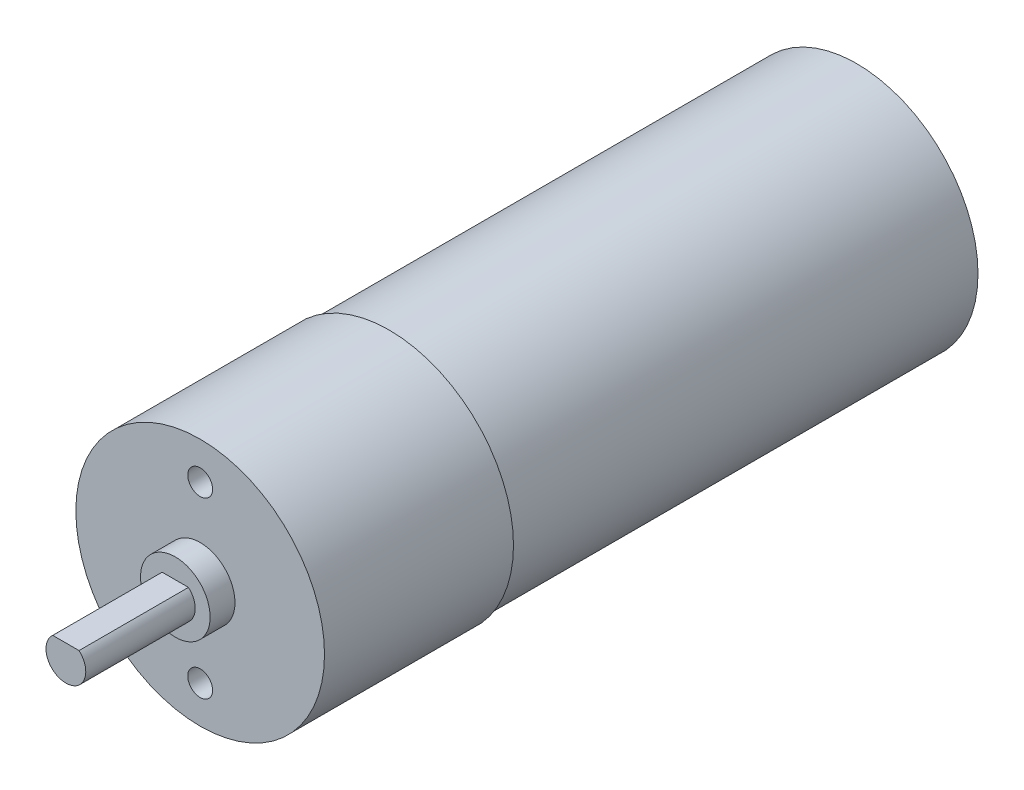
ISO-10303-21;
HEADER;
FILE_DESCRIPTION(('STEP AP214'),'2;1');
FILE_NAME('part.step','',(''),(''),'','','');
FILE_SCHEMA(('AUTOMOTIVE_DESIGN { 1 0 10303 214 1 1 1 1 }'));
ENDSEC;
DATA;
#1=APPLICATION_CONTEXT('core data for automotive mechanical design processes');
#2=APPLICATION_PROTOCOL_DEFINITION('international standard','automotive_design',2000,#1);
#3=PRODUCT_CONTEXT('',#1,'mechanical');
#4=PRODUCT('Part','Part','',(#3));
#5=PRODUCT_RELATED_PRODUCT_CATEGORY('part','',(#4));
#6=PRODUCT_DEFINITION_FORMATION('','',#4);
#7=PRODUCT_DEFINITION_CONTEXT('part definition',#1,'design');
#8=PRODUCT_DEFINITION('design','',#6,#7);
#9=PRODUCT_DEFINITION_SHAPE('','',#8);
#10=(LENGTH_UNIT() NAMED_UNIT(*) SI_UNIT(.MILLI.,.METRE.));
#11=(NAMED_UNIT(*) PLANE_ANGLE_UNIT() SI_UNIT($,.RADIAN.));
#12=(NAMED_UNIT(*) SI_UNIT($,.STERADIAN.) SOLID_ANGLE_UNIT());
#13=UNCERTAINTY_MEASURE_WITH_UNIT(LENGTH_MEASURE(1.E-05),#10,'distance_accuracy_value','');
#14=(GEOMETRIC_REPRESENTATION_CONTEXT(3) GLOBAL_UNCERTAINTY_ASSIGNED_CONTEXT((#13)) GLOBAL_UNIT_ASSIGNED_CONTEXT((#10,
#11,#12)) REPRESENTATION_CONTEXT('',''));
#15=CARTESIAN_POINT('',(0.,0.,0.));
#16=DIRECTION('',(0.,0.,1.));
#17=DIRECTION('',(1.,0.,0.));
#18=AXIS2_PLACEMENT_3D('',#15,#16,#17);
#19=CARTESIAN_POINT('',(0.,0.,47.));
#20=DIRECTION('',(0.,0.,-1.));
#21=DIRECTION('',(-1.,0.,0.));
#22=AXIS2_PLACEMENT_3D('',#19,#20,#21);
#23=CYLINDRICAL_SURFACE('',#22,12.2);
#24=CARTESIAN_POINT('',(0.,0.,47.));
#25=DIRECTION('',(0.,0.,1.));
#26=DIRECTION('',(1.,0.,0.));
#27=AXIS2_PLACEMENT_3D('',#24,#25,#26);
#28=CIRCLE('',#27,12.2);
#29=CARTESIAN_POINT('',(12.2,0.,47.));
#30=VERTEX_POINT('',#29);
#31=EDGE_CURVE('E48',#30,#30,#28,.T.);
#32=ORIENTED_EDGE('',*,*,#31,.F.);
#33=EDGE_LOOP('',(#32));
#34=FACE_BOUND('',#33,.T.);
#35=CARTESIAN_POINT('',(0.,0.,0.));
#36=DIRECTION('',(0.,0.,1.));
#37=DIRECTION('',(1.,0.,0.));
#38=AXIS2_PLACEMENT_3D('',#35,#36,#37);
#39=CIRCLE('',#38,12.2);
#40=CARTESIAN_POINT('',(12.2,0.,0.));
#41=VERTEX_POINT('',#40);
#42=EDGE_CURVE('E43',#41,#41,#39,.T.);
#43=ORIENTED_EDGE('',*,*,#42,.T.);
#44=EDGE_LOOP('',(#43));
#45=FACE_BOUND('',#44,.T.);
#46=ADVANCED_FACE('F40',(#34,#45),#23,.T.);
#47=CARTESIAN_POINT('',(0.,0.,0.));
#48=DIRECTION('',(0.,0.,1.));
#49=DIRECTION('',(1.,0.,0.));
#50=AXIS2_PLACEMENT_3D('',#47,#48,#49);
#51=PLANE('',#50);
#52=ORIENTED_EDGE('',*,*,#42,.F.);
#53=EDGE_LOOP('',(#52));
#54=FACE_BOUND('',#53,.T.);
#55=ADVANCED_FACE('F123',(#54),#51,.F.);
#56=CARTESIAN_POINT('',(0.,0.,66.));
#57=DIRECTION('',(0.,0.,-1.));
#58=DIRECTION('',(-1.,0.,0.));
#59=AXIS2_PLACEMENT_3D('',#56,#57,#58);
#60=CYLINDRICAL_SURFACE('',#59,12.5);
#61=CARTESIAN_POINT('',(0.,0.,66.));
#62=DIRECTION('',(0.,0.,1.));
#63=DIRECTION('',(1.,0.,0.));
#64=AXIS2_PLACEMENT_3D('',#61,#62,#63);
#65=CIRCLE('',#64,12.5);
#66=CARTESIAN_POINT('',(12.5,0.,66.));
#67=VERTEX_POINT('',#66);
#68=EDGE_CURVE('E112',#67,#67,#65,.T.);
#69=ORIENTED_EDGE('',*,*,#68,.F.);
#70=EDGE_LOOP('',(#69));
#71=FACE_BOUND('',#70,.T.);
#72=CARTESIAN_POINT('',(0.,0.,47.));
#73=DIRECTION('',(0.,0.,1.));
#74=DIRECTION('',(1.,0.,0.));
#75=AXIS2_PLACEMENT_3D('',#72,#73,#74);
#76=CIRCLE('',#75,12.5);
#77=CARTESIAN_POINT('',(12.5,0.,47.));
#78=VERTEX_POINT('',#77);
#79=EDGE_CURVE('E110',#78,#78,#76,.T.);
#80=ORIENTED_EDGE('',*,*,#79,.T.);
#81=EDGE_LOOP('',(#80));
#82=FACE_BOUND('',#81,.T.);
#83=ADVANCED_FACE('F125',(#71,#82),#60,.T.);
#84=CARTESIAN_POINT('',(0.,0.,66.));
#85=DIRECTION('',(0.,0.,1.));
#86=DIRECTION('',(1.,0.,0.));
#87=AXIS2_PLACEMENT_3D('',#84,#85,#86);
#88=PLANE('',#87);
#89=CARTESIAN_POINT('',(0.,8.75,66.));
#90=DIRECTION('',(0.,0.,1.));
#91=DIRECTION('',(1.,0.,0.));
#92=AXIS2_PLACEMENT_3D('',#89,#90,#91);
#93=CIRCLE('',#92,1.25);
#94=CARTESIAN_POINT('',(1.25,8.75,66.));
#95=VERTEX_POINT('',#94);
#96=EDGE_CURVE('E88',#95,#95,#93,.T.);
#97=ORIENTED_EDGE('',*,*,#96,.F.);
#98=EDGE_LOOP('',(#97));
#99=FACE_BOUND('',#98,.T.);
#100=CARTESIAN_POINT('',(0.,-8.75,66.));
#101=DIRECTION('',(0.,0.,1.));
#102=DIRECTION('',(1.,0.,0.));
#103=AXIS2_PLACEMENT_3D('',#100,#101,#102);
#104=CIRCLE('',#103,1.25);
#105=CARTESIAN_POINT('',(1.25,-8.75,66.));
#106=VERTEX_POINT('',#105);
#107=EDGE_CURVE('E87',#106,#106,#104,.T.);
#108=ORIENTED_EDGE('',*,*,#107,.F.);
#109=EDGE_LOOP('',(#108));
#110=FACE_BOUND('',#109,.T.);
#111=CARTESIAN_POINT('',(0.,0.,66.));
#112=DIRECTION('',(0.,0.,1.));
#113=DIRECTION('',(1.,0.,0.));
#114=AXIS2_PLACEMENT_3D('',#111,#112,#113);
#115=CIRCLE('',#114,3.5);
#116=CARTESIAN_POINT('',(3.5,0.,66.));
#117=VERTEX_POINT('',#116);
#118=EDGE_CURVE('E11',#117,#117,#115,.T.);
#119=ORIENTED_EDGE('',*,*,#118,.F.);
#120=EDGE_LOOP('',(#119));
#121=FACE_BOUND('',#120,.T.);
#122=ORIENTED_EDGE('',*,*,#68,.T.);
#123=EDGE_LOOP('',(#122));
#124=FACE_BOUND('',#123,.T.);
#125=ADVANCED_FACE('F130',(#99,#110,#121,#124),#88,.T.);
#126=CARTESIAN_POINT('',(0.,0.,47.));
#127=DIRECTION('',(0.,0.,1.));
#128=DIRECTION('',(1.,0.,0.));
#129=AXIS2_PLACEMENT_3D('',#126,#127,#128);
#130=PLANE('',#129);
#131=ORIENTED_EDGE('',*,*,#31,.T.);
#132=EDGE_LOOP('',(#131));
#133=FACE_BOUND('',#132,.T.);
#134=ORIENTED_EDGE('',*,*,#79,.F.);
#135=EDGE_LOOP('',(#134));
#136=FACE_BOUND('',#135,.T.);
#137=ADVANCED_FACE('F135',(#133,#136),#130,.F.);
#138=CARTESIAN_POINT('',(0.,0.,68.5));
#139=DIRECTION('',(0.,0.,-1.));
#140=DIRECTION('',(-1.,0.,0.));
#141=AXIS2_PLACEMENT_3D('',#138,#139,#140);
#142=CYLINDRICAL_SURFACE('',#141,3.5);
#143=CARTESIAN_POINT('',(0.,0.,68.5));
#144=DIRECTION('',(0.,0.,1.));
#145=DIRECTION('',(1.,0.,0.));
#146=AXIS2_PLACEMENT_3D('',#143,#144,#145);
#147=CIRCLE('',#146,3.5);
#148=CARTESIAN_POINT('',(3.5,0.,68.5));
#149=VERTEX_POINT('',#148);
#150=EDGE_CURVE('E108',#149,#149,#147,.T.);
#151=ORIENTED_EDGE('',*,*,#150,.F.);
#152=EDGE_LOOP('',(#151));
#153=FACE_BOUND('',#152,.T.);
#154=ORIENTED_EDGE('',*,*,#118,.T.);
#155=EDGE_LOOP('',(#154));
#156=FACE_BOUND('',#155,.T.);
#157=ADVANCED_FACE('F138',(#153,#156),#142,.T.);
#158=CARTESIAN_POINT('',(0.,0.,68.5));
#159=DIRECTION('',(0.,0.,1.));
#160=DIRECTION('',(1.,0.,0.));
#161=AXIS2_PLACEMENT_3D('',#158,#159,#160);
#162=PLANE('',#161);
#163=CARTESIAN_POINT('',(0.,0.,68.5));
#164=DIRECTION('',(0.,0.,1.));
#165=DIRECTION('',(1.,0.,0.));
#166=AXIS2_PLACEMENT_3D('',#163,#164,#165);
#167=CIRCLE('',#166,2.);
#168=CARTESIAN_POINT('',(-1.3228756555323,1.5,68.5));
#169=VERTEX_POINT('',#168);
#170=CARTESIAN_POINT('',(1.32287565553229,1.5,68.5));
#171=VERTEX_POINT('',#170);
#172=EDGE_CURVE('E70',#169,#171,#167,.T.);
#173=ORIENTED_EDGE('',*,*,#172,.F.);
#174=DIRECTION('',(-1.,0.,0.));
#175=VECTOR('',#174,1.);
#176=CARTESIAN_POINT('',(0.,1.5,68.5));
#177=LINE('',#176,#175);
#178=EDGE_CURVE('E55',#171,#169,#177,.T.);
#179=ORIENTED_EDGE('',*,*,#178,.F.);
#180=EDGE_LOOP('',(#173,#179));
#181=FACE_BOUND('',#180,.T.);
#182=ORIENTED_EDGE('',*,*,#150,.T.);
#183=EDGE_LOOP('',(#182));
#184=FACE_BOUND('',#183,.T.);
#185=ADVANCED_FACE('F144',(#181,#184),#162,.T.);
#186=CARTESIAN_POINT('',(0.,0.,79.5));
#187=DIRECTION('',(0.,0.,-1.));
#188=DIRECTION('',(-1.,0.,0.));
#189=AXIS2_PLACEMENT_3D('',#186,#187,#188);
#190=CYLINDRICAL_SURFACE('',#189,2.);
#191=ORIENTED_EDGE('',*,*,#172,.T.);
#192=DIRECTION('',(0.,0.,-1.));
#193=VECTOR('',#192,1.);
#194=CARTESIAN_POINT('',(1.32287565553229,1.5,79.5));
#195=LINE('',#194,#193);
#196=CARTESIAN_POINT('',(1.32287565553229,1.5,79.5));
#197=VERTEX_POINT('',#196);
#198=EDGE_CURVE('E106',#197,#171,#195,.T.);
#199=ORIENTED_EDGE('',*,*,#198,.F.);
#200=CARTESIAN_POINT('',(0.,0.,79.5));
#201=DIRECTION('',(0.,0.,1.));
#202=DIRECTION('',(1.,0.,0.));
#203=AXIS2_PLACEMENT_3D('',#200,#201,#202);
#204=CIRCLE('',#203,2.);
#205=CARTESIAN_POINT('',(-1.3228756555323,1.5,79.5));
#206=VERTEX_POINT('',#205);
#207=EDGE_CURVE('E98',#206,#197,#204,.T.);
#208=ORIENTED_EDGE('',*,*,#207,.F.);
#209=DIRECTION('',(0.,0.,-1.));
#210=VECTOR('',#209,1.);
#211=CARTESIAN_POINT('',(-1.3228756555323,1.5,79.5));
#212=LINE('',#211,#210);
#213=EDGE_CURVE('E101',#206,#169,#212,.T.);
#214=ORIENTED_EDGE('',*,*,#213,.T.);
#215=EDGE_LOOP('',(#191,#199,#208,#214));
#216=FACE_BOUND('',#215,.T.);
#217=ADVANCED_FACE('F148',(#216),#190,.T.);
#218=CARTESIAN_POINT('',(0.,1.5,79.5));
#219=DIRECTION('',(0.,-1.,0.));
#220=DIRECTION('',(0.,0.,-1.));
#221=AXIS2_PLACEMENT_3D('',#218,#219,#220);
#222=PLANE('',#221);
#223=ORIENTED_EDGE('',*,*,#178,.T.);
#224=ORIENTED_EDGE('',*,*,#213,.F.);
#225=DIRECTION('',(-1.,0.,0.));
#226=VECTOR('',#225,1.);
#227=CARTESIAN_POINT('',(0.,1.5,79.5));
#228=LINE('',#227,#226);
#229=EDGE_CURVE('E63',#197,#206,#228,.T.);
#230=ORIENTED_EDGE('',*,*,#229,.F.);
#231=ORIENTED_EDGE('',*,*,#198,.T.);
#232=EDGE_LOOP('',(#223,#224,#230,#231));
#233=FACE_BOUND('',#232,.T.);
#234=ADVANCED_FACE('F151',(#233),#222,.F.);
#235=CARTESIAN_POINT('',(0.,0.,79.5));
#236=DIRECTION('',(0.,0.,1.));
#237=DIRECTION('',(1.,0.,0.));
#238=AXIS2_PLACEMENT_3D('',#235,#236,#237);
#239=PLANE('',#238);
#240=ORIENTED_EDGE('',*,*,#207,.T.);
#241=ORIENTED_EDGE('',*,*,#229,.T.);
#242=EDGE_LOOP('',(#240,#241));
#243=FACE_BOUND('',#242,.T.);
#244=ADVANCED_FACE('F155',(#243),#239,.T.);
#245=CARTESIAN_POINT('',(0.,-8.75,46.));
#246=DIRECTION('',(0.,0.,1.));
#247=DIRECTION('',(1.,0.,0.));
#248=AXIS2_PLACEMENT_3D('',#245,#246,#247);
#249=CONICAL_SURFACE('',#248,1.25,1.02974425867665);
#250=CARTESIAN_POINT('',(0.,-8.75,45.2489242262155));
#251=VERTEX_POINT('',#250);
#252=VERTEX_LOOP('',#251);
#253=FACE_BOUND('',#252,.T.);
#254=CARTESIAN_POINT('',(0.,-8.75,46.));
#255=DIRECTION('',(0.,0.,1.));
#256=DIRECTION('',(1.,0.,0.));
#257=AXIS2_PLACEMENT_3D('',#254,#255,#256);
#258=CIRCLE('',#257,1.25);
#259=CARTESIAN_POINT('',(1.24999999999999,-8.75,46.));
#260=VERTEX_POINT('',#259);
#261=EDGE_CURVE('E91',#260,#260,#258,.T.);
#262=ORIENTED_EDGE('',*,*,#261,.T.);
#263=EDGE_LOOP('',(#262));
#264=FACE_BOUND('',#263,.T.);
#265=ADVANCED_FACE('F159',(#253,#264),#249,.F.);
#266=CARTESIAN_POINT('',(0.,-8.75,66.));
#267=DIRECTION('',(0.,0.,1.));
#268=DIRECTION('',(1.,0.,0.));
#269=AXIS2_PLACEMENT_3D('',#266,#267,#268);
#270=CYLINDRICAL_SURFACE('',#269,1.25);
#271=ORIENTED_EDGE('',*,*,#261,.F.);
#272=EDGE_LOOP('',(#271));
#273=FACE_BOUND('',#272,.T.);
#274=ORIENTED_EDGE('',*,*,#107,.T.);
#275=EDGE_LOOP('',(#274));
#276=FACE_BOUND('',#275,.T.);
#277=ADVANCED_FACE('F81',(#273,#276),#270,.F.);
#278=CARTESIAN_POINT('',(0.,8.75,46.));
#279=DIRECTION('',(0.,0.,1.));
#280=DIRECTION('',(1.,0.,0.));
#281=AXIS2_PLACEMENT_3D('',#278,#279,#280);
#282=CONICAL_SURFACE('',#281,1.25,1.02974425867665);
#283=CARTESIAN_POINT('',(0.,8.75,45.2489242262155));
#284=VERTEX_POINT('',#283);
#285=VERTEX_LOOP('',#284);
#286=FACE_BOUND('',#285,.T.);
#287=CARTESIAN_POINT('',(0.,8.75,46.));
#288=DIRECTION('',(0.,0.,1.));
#289=DIRECTION('',(1.,0.,0.));
#290=AXIS2_PLACEMENT_3D('',#287,#288,#289);
#291=CIRCLE('',#290,1.25);
#292=CARTESIAN_POINT('',(1.24999999999999,8.75,46.));
#293=VERTEX_POINT('',#292);
#294=EDGE_CURVE('E85',#293,#293,#291,.T.);
#295=ORIENTED_EDGE('',*,*,#294,.T.);
#296=EDGE_LOOP('',(#295));
#297=FACE_BOUND('',#296,.T.);
#298=ADVANCED_FACE('F77',(#286,#297),#282,.F.);
#299=CARTESIAN_POINT('',(0.,8.75,66.));
#300=DIRECTION('',(0.,0.,1.));
#301=DIRECTION('',(1.,0.,0.));
#302=AXIS2_PLACEMENT_3D('',#299,#300,#301);
#303=CYLINDRICAL_SURFACE('',#302,1.25);
#304=ORIENTED_EDGE('',*,*,#294,.F.);
#305=EDGE_LOOP('',(#304));
#306=FACE_BOUND('',#305,.T.);
#307=ORIENTED_EDGE('',*,*,#96,.T.);
#308=EDGE_LOOP('',(#307));
#309=FACE_BOUND('',#308,.T.);
#310=ADVANCED_FACE('F80',(#306,#309),#303,.F.);
#311=CLOSED_SHELL('',(#46,#55,#83,#125,#137,#157,#185,#217,#234,#244,#265,#277,#298,#310));
#312=MANIFOLD_SOLID_BREP('B2',#311);
#313=ADVANCED_BREP_SHAPE_REPRESENTATION('',(#18,#312),#14);
#314=SHAPE_DEFINITION_REPRESENTATION(#9,#313);
ENDSEC;
END-ISO-10303-21;
